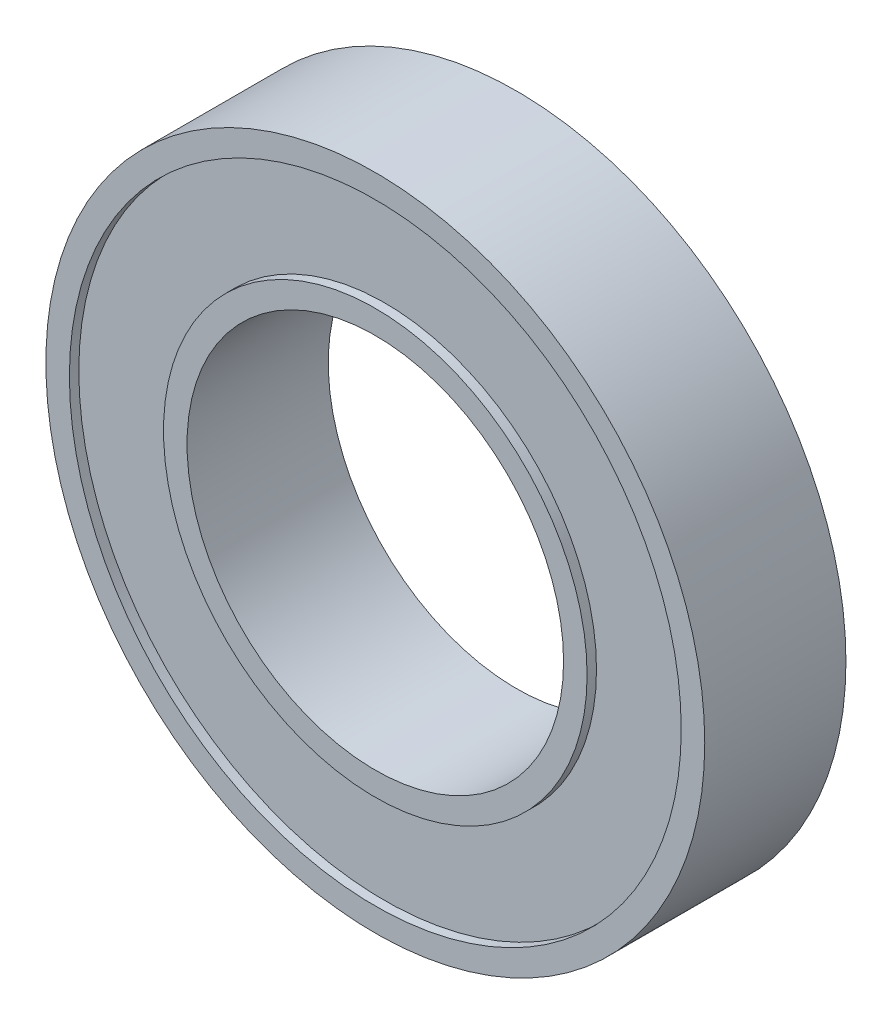
ISO-10303-21;
HEADER;
FILE_DESCRIPTION(('STEP AP214'),'2;1');
FILE_NAME('part.step','',(''),(''),'','','');
FILE_SCHEMA(('AUTOMOTIVE_DESIGN { 1 0 10303 214 1 1 1 1 }'));
ENDSEC;
DATA;
#1=APPLICATION_CONTEXT('core data for automotive mechanical design processes');
#2=APPLICATION_PROTOCOL_DEFINITION('international standard','automotive_design',2000,#1);
#3=PRODUCT_CONTEXT('',#1,'mechanical');
#4=PRODUCT('Part','Part','',(#3));
#5=PRODUCT_RELATED_PRODUCT_CATEGORY('part','',(#4));
#6=PRODUCT_DEFINITION_FORMATION('','',#4);
#7=PRODUCT_DEFINITION_CONTEXT('part definition',#1,'design');
#8=PRODUCT_DEFINITION('design','',#6,#7);
#9=PRODUCT_DEFINITION_SHAPE('','',#8);
#10=(LENGTH_UNIT() NAMED_UNIT(*) SI_UNIT(.MILLI.,.METRE.));
#11=(NAMED_UNIT(*) PLANE_ANGLE_UNIT() SI_UNIT($,.RADIAN.));
#12=(NAMED_UNIT(*) SI_UNIT($,.STERADIAN.) SOLID_ANGLE_UNIT());
#13=UNCERTAINTY_MEASURE_WITH_UNIT(LENGTH_MEASURE(1.E-05),#10,'distance_accuracy_value','');
#14=(GEOMETRIC_REPRESENTATION_CONTEXT(3) GLOBAL_UNCERTAINTY_ASSIGNED_CONTEXT((#13)) GLOBAL_UNIT_ASSIGNED_CONTEXT((#10,
#11,#12)) REPRESENTATION_CONTEXT('',''));
#15=CARTESIAN_POINT('',(0.,0.,0.));
#16=DIRECTION('',(0.,0.,1.));
#17=DIRECTION('',(1.,0.,0.));
#18=AXIS2_PLACEMENT_3D('',#15,#16,#17);
#19=CARTESIAN_POINT('',(0.,0.,-7.5));
#20=DIRECTION('',(0.,0.,1.));
#21=DIRECTION('',(1.,0.,0.));
#22=AXIS2_PLACEMENT_3D('',#19,#20,#21);
#23=PLANE('',#22);
#24=CARTESIAN_POINT('',(0.,0.,-7.5));
#25=DIRECTION('',(0.,0.,1.));
#26=DIRECTION('',(1.,0.,0.));
#27=AXIS2_PLACEMENT_3D('',#24,#25,#26);
#28=CIRCLE('',#27,20.);
#29=CARTESIAN_POINT('',(20.,0.,-7.5));
#30=VERTEX_POINT('',#29);
#31=EDGE_CURVE('E52',#30,#30,#28,.T.);
#32=ORIENTED_EDGE('',*,*,#31,.T.);
#33=EDGE_LOOP('',(#32));
#34=FACE_BOUND('',#33,.T.);
#35=CARTESIAN_POINT('',(0.,0.,-7.5));
#36=DIRECTION('',(0.,0.,1.));
#37=DIRECTION('',(1.,0.,0.));
#38=AXIS2_PLACEMENT_3D('',#35,#36,#37);
#39=CIRCLE('',#38,22.5);
#40=CARTESIAN_POINT('',(22.5,0.,-7.5));
#41=VERTEX_POINT('',#40);
#42=EDGE_CURVE('E84',#41,#41,#39,.T.);
#43=ORIENTED_EDGE('',*,*,#42,.F.);
#44=EDGE_LOOP('',(#43));
#45=FACE_BOUND('',#44,.T.);
#46=ADVANCED_FACE('F37',(#34,#45),#23,.F.);
#47=CARTESIAN_POINT('',(0.,0.,7.5));
#48=DIRECTION('',(0.,0.,1.));
#49=DIRECTION('',(1.,0.,0.));
#50=AXIS2_PLACEMENT_3D('',#47,#48,#49);
#51=PLANE('',#50);
#52=CARTESIAN_POINT('',(0.,0.,7.5));
#53=DIRECTION('',(0.,0.,1.));
#54=DIRECTION('',(1.,0.,0.));
#55=AXIS2_PLACEMENT_3D('',#52,#53,#54);
#56=CIRCLE('',#55,20.);
#57=CARTESIAN_POINT('',(20.,0.,7.5));
#58=VERTEX_POINT('',#57);
#59=EDGE_CURVE('E50',#58,#58,#56,.T.);
#60=ORIENTED_EDGE('',*,*,#59,.F.);
#61=EDGE_LOOP('',(#60));
#62=FACE_BOUND('',#61,.T.);
#63=CARTESIAN_POINT('',(0.,0.,7.5));
#64=DIRECTION('',(0.,0.,1.));
#65=DIRECTION('',(1.,0.,0.));
#66=AXIS2_PLACEMENT_3D('',#63,#64,#65);
#67=CIRCLE('',#66,22.5);
#68=CARTESIAN_POINT('',(22.5,0.,7.5));
#69=VERTEX_POINT('',#68);
#70=EDGE_CURVE('E68',#69,#69,#67,.T.);
#71=ORIENTED_EDGE('',*,*,#70,.T.);
#72=EDGE_LOOP('',(#71));
#73=FACE_BOUND('',#72,.T.);
#74=ADVANCED_FACE('F102',(#62,#73),#51,.T.);
#75=CARTESIAN_POINT('',(0.,0.,7.5));
#76=DIRECTION('',(0.,0.,1.));
#77=DIRECTION('',(1.,0.,0.));
#78=AXIS2_PLACEMENT_3D('',#75,#76,#77);
#79=CIRCLE('',#78,32.5);
#80=CARTESIAN_POINT('',(32.5,0.,7.5));
#81=VERTEX_POINT('',#80);
#82=EDGE_CURVE('E60',#81,#81,#79,.T.);
#83=ORIENTED_EDGE('',*,*,#82,.F.);
#84=EDGE_LOOP('',(#83));
#85=FACE_BOUND('',#84,.T.);
#86=CARTESIAN_POINT('',(0.,0.,7.5));
#87=DIRECTION('',(0.,0.,1.));
#88=DIRECTION('',(1.,0.,0.));
#89=AXIS2_PLACEMENT_3D('',#86,#87,#88);
#90=CIRCLE('',#89,35.);
#91=CARTESIAN_POINT('',(35.,0.,7.5));
#92=VERTEX_POINT('',#91);
#93=EDGE_CURVE('E10',#92,#92,#90,.T.);
#94=ORIENTED_EDGE('',*,*,#93,.T.);
#95=EDGE_LOOP('',(#94));
#96=FACE_BOUND('',#95,.T.);
#97=ADVANCED_FACE('F108',(#85,#96),#51,.T.);
#98=CARTESIAN_POINT('',(0.,0.,-7.5));
#99=DIRECTION('',(0.,0.,1.));
#100=DIRECTION('',(1.,0.,0.));
#101=AXIS2_PLACEMENT_3D('',#98,#99,#100);
#102=CIRCLE('',#101,32.5);
#103=CARTESIAN_POINT('',(32.5,0.,-7.5));
#104=VERTEX_POINT('',#103);
#105=EDGE_CURVE('E76',#104,#104,#102,.T.);
#106=ORIENTED_EDGE('',*,*,#105,.T.);
#107=EDGE_LOOP('',(#106));
#108=FACE_BOUND('',#107,.T.);
#109=CARTESIAN_POINT('',(0.,0.,-7.5));
#110=DIRECTION('',(0.,0.,1.));
#111=DIRECTION('',(1.,0.,0.));
#112=AXIS2_PLACEMENT_3D('',#109,#110,#111);
#113=CIRCLE('',#112,35.);
#114=CARTESIAN_POINT('',(35.,0.,-7.5));
#115=VERTEX_POINT('',#114);
#116=EDGE_CURVE('E41',#115,#115,#113,.T.);
#117=ORIENTED_EDGE('',*,*,#116,.F.);
#118=EDGE_LOOP('',(#117));
#119=FACE_BOUND('',#118,.T.);
#120=ADVANCED_FACE('F104',(#108,#119),#23,.F.);
#121=CARTESIAN_POINT('',(0.,0.,7.5));
#122=DIRECTION('',(0.,0.,-1.));
#123=DIRECTION('',(-1.,0.,0.));
#124=AXIS2_PLACEMENT_3D('',#121,#122,#123);
#125=CYLINDRICAL_SURFACE('',#124,35.);
#126=ORIENTED_EDGE('',*,*,#93,.F.);
#127=EDGE_LOOP('',(#126));
#128=FACE_BOUND('',#127,.T.);
#129=ORIENTED_EDGE('',*,*,#116,.T.);
#130=EDGE_LOOP('',(#129));
#131=FACE_BOUND('',#130,.T.);
#132=ADVANCED_FACE('F39',(#128,#131),#125,.T.);
#133=CARTESIAN_POINT('',(0.,0.,7.5));
#134=DIRECTION('',(0.,0.,-1.));
#135=DIRECTION('',(-1.,0.,0.));
#136=AXIS2_PLACEMENT_3D('',#133,#134,#135);
#137=CYLINDRICAL_SURFACE('',#136,20.);
#138=ORIENTED_EDGE('',*,*,#59,.T.);
#139=EDGE_LOOP('',(#138));
#140=FACE_BOUND('',#139,.T.);
#141=ORIENTED_EDGE('',*,*,#31,.F.);
#142=EDGE_LOOP('',(#141));
#143=FACE_BOUND('',#142,.T.);
#144=ADVANCED_FACE('F117',(#140,#143),#137,.F.);
#145=CARTESIAN_POINT('',(0.,0.,6.5));
#146=DIRECTION('',(0.,0.,1.));
#147=DIRECTION('',(1.,0.,0.));
#148=AXIS2_PLACEMENT_3D('',#145,#146,#147);
#149=CYLINDRICAL_SURFACE('',#148,32.5);
#150=CARTESIAN_POINT('',(0.,0.,6.5));
#151=DIRECTION('',(0.,0.,1.));
#152=DIRECTION('',(1.,0.,0.));
#153=AXIS2_PLACEMENT_3D('',#150,#151,#152);
#154=CIRCLE('',#153,32.5);
#155=CARTESIAN_POINT('',(32.5,0.,6.5));
#156=VERTEX_POINT('',#155);
#157=EDGE_CURVE('E56',#156,#156,#154,.T.);
#158=ORIENTED_EDGE('',*,*,#157,.F.);
#159=EDGE_LOOP('',(#158));
#160=FACE_BOUND('',#159,.T.);
#161=ORIENTED_EDGE('',*,*,#82,.T.);
#162=EDGE_LOOP('',(#161));
#163=FACE_BOUND('',#162,.T.);
#164=ADVANCED_FACE('F141',(#160,#163),#149,.F.);
#165=CARTESIAN_POINT('',(0.,0.,6.5));
#166=DIRECTION('',(0.,0.,1.));
#167=DIRECTION('',(1.,0.,0.));
#168=AXIS2_PLACEMENT_3D('',#165,#166,#167);
#169=PLANE('',#168);
#170=CARTESIAN_POINT('',(0.,0.,6.5));
#171=DIRECTION('',(0.,0.,1.));
#172=DIRECTION('',(1.,0.,0.));
#173=AXIS2_PLACEMENT_3D('',#170,#171,#172);
#174=CIRCLE('',#173,22.5);
#175=CARTESIAN_POINT('',(22.5,0.,6.5));
#176=VERTEX_POINT('',#175);
#177=EDGE_CURVE('E64',#176,#176,#174,.T.);
#178=ORIENTED_EDGE('',*,*,#177,.F.);
#179=EDGE_LOOP('',(#178));
#180=FACE_BOUND('',#179,.T.);
#181=ORIENTED_EDGE('',*,*,#157,.T.);
#182=EDGE_LOOP('',(#181));
#183=FACE_BOUND('',#182,.T.);
#184=ADVANCED_FACE('F137',(#180,#183),#169,.T.);
#185=CARTESIAN_POINT('',(0.,0.,6.5));
#186=DIRECTION('',(0.,0.,1.));
#187=DIRECTION('',(1.,0.,0.));
#188=AXIS2_PLACEMENT_3D('',#185,#186,#187);
#189=CYLINDRICAL_SURFACE('',#188,22.5);
#190=ORIENTED_EDGE('',*,*,#177,.T.);
#191=EDGE_LOOP('',(#190));
#192=FACE_BOUND('',#191,.T.);
#193=ORIENTED_EDGE('',*,*,#70,.F.);
#194=EDGE_LOOP('',(#193));
#195=FACE_BOUND('',#194,.T.);
#196=ADVANCED_FACE('F131',(#192,#195),#189,.T.);
#197=CARTESIAN_POINT('',(0.,0.,-6.5));
#198=DIRECTION('',(0.,0.,-1.));
#199=DIRECTION('',(1.,0.,0.));
#200=AXIS2_PLACEMENT_3D('',#197,#198,#199);
#201=PLANE('',#200);
#202=CARTESIAN_POINT('',(0.,0.,-6.5));
#203=DIRECTION('',(0.,0.,1.));
#204=DIRECTION('',(1.,0.,0.));
#205=AXIS2_PLACEMENT_3D('',#202,#203,#204);
#206=CIRCLE('',#205,32.5);
#207=CARTESIAN_POINT('',(32.5,0.,-6.5));
#208=VERTEX_POINT('',#207);
#209=EDGE_CURVE('E72',#208,#208,#206,.T.);
#210=ORIENTED_EDGE('',*,*,#209,.F.);
#211=EDGE_LOOP('',(#210));
#212=FACE_BOUND('',#211,.T.);
#213=CARTESIAN_POINT('',(0.,0.,-6.5));
#214=DIRECTION('',(0.,0.,1.));
#215=DIRECTION('',(1.,0.,0.));
#216=AXIS2_PLACEMENT_3D('',#213,#214,#215);
#217=CIRCLE('',#216,22.5);
#218=CARTESIAN_POINT('',(22.5,0.,-6.5));
#219=VERTEX_POINT('',#218);
#220=EDGE_CURVE('E80',#219,#219,#217,.T.);
#221=ORIENTED_EDGE('',*,*,#220,.T.);
#222=EDGE_LOOP('',(#221));
#223=FACE_BOUND('',#222,.T.);
#224=ADVANCED_FACE('F92',(#212,#223),#201,.T.);
#225=CARTESIAN_POINT('',(0.,0.,-6.5));
#226=DIRECTION('',(0.,0.,-1.));
#227=DIRECTION('',(-1.,0.,0.));
#228=AXIS2_PLACEMENT_3D('',#225,#226,#227);
#229=CYLINDRICAL_SURFACE('',#228,32.5);
#230=ORIENTED_EDGE('',*,*,#209,.T.);
#231=EDGE_LOOP('',(#230));
#232=FACE_BOUND('',#231,.T.);
#233=ORIENTED_EDGE('',*,*,#105,.F.);
#234=EDGE_LOOP('',(#233));
#235=FACE_BOUND('',#234,.T.);
#236=ADVANCED_FACE('F97',(#232,#235),#229,.F.);
#237=CARTESIAN_POINT('',(0.,0.,-6.5));
#238=DIRECTION('',(0.,0.,-1.));
#239=DIRECTION('',(-1.,0.,0.));
#240=AXIS2_PLACEMENT_3D('',#237,#238,#239);
#241=CYLINDRICAL_SURFACE('',#240,22.5);
#242=ORIENTED_EDGE('',*,*,#220,.F.);
#243=EDGE_LOOP('',(#242));
#244=FACE_BOUND('',#243,.T.);
#245=ORIENTED_EDGE('',*,*,#42,.T.);
#246=EDGE_LOOP('',(#245));
#247=FACE_BOUND('',#246,.T.);
#248=ADVANCED_FACE('F94',(#244,#247),#241,.T.);
#249=CLOSED_SHELL('',(#46,#74,#97,#120,#132,#144,#164,#184,#196,#224,#236,#248));
#250=MANIFOLD_SOLID_BREP('B2',#249);
#251=ADVANCED_BREP_SHAPE_REPRESENTATION('',(#18,#250),#14);
#252=SHAPE_DEFINITION_REPRESENTATION(#9,#251);
ENDSEC;
END-ISO-10303-21;
